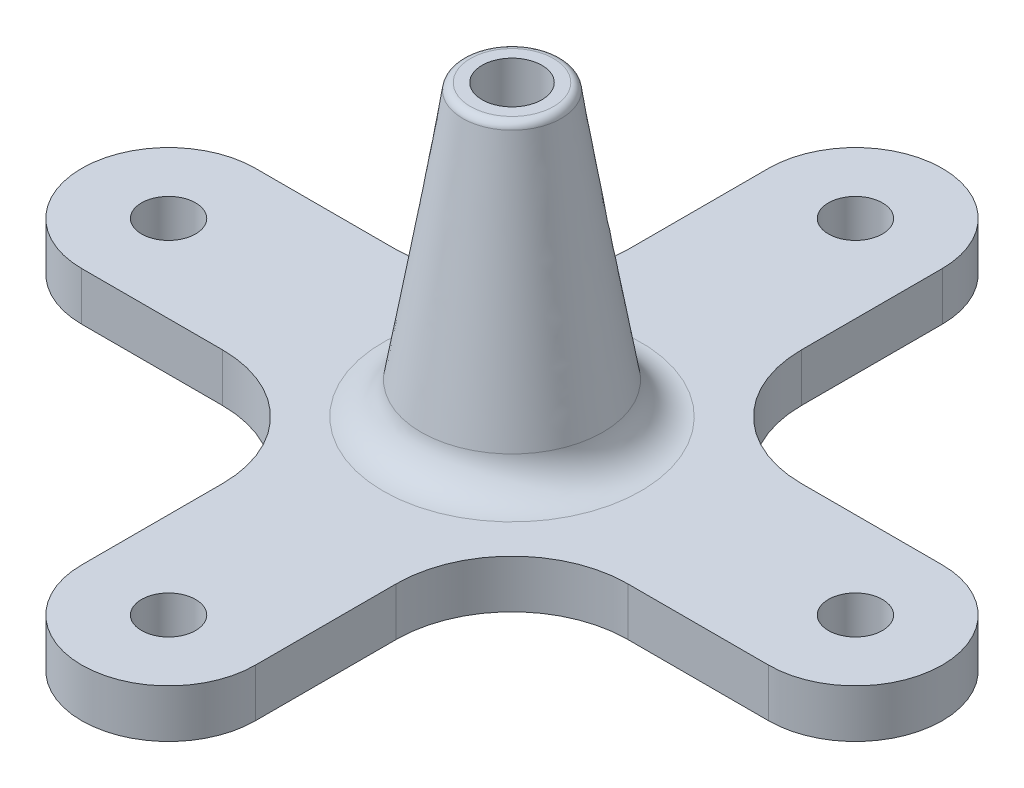
ISO-10303-21;
HEADER;
FILE_DESCRIPTION(('STEP AP214'),'2;1');
FILE_NAME('part.step','',(''),(''),'','','');
FILE_SCHEMA(('AUTOMOTIVE_DESIGN { 1 0 10303 214 1 1 1 1 }'));
ENDSEC;
DATA;
#1=APPLICATION_CONTEXT('core data for automotive mechanical design processes');
#2=APPLICATION_PROTOCOL_DEFINITION('international standard','automotive_design',2000,#1);
#3=PRODUCT_CONTEXT('',#1,'mechanical');
#4=PRODUCT('Part','Part','',(#3));
#5=PRODUCT_RELATED_PRODUCT_CATEGORY('part','',(#4));
#6=PRODUCT_DEFINITION_FORMATION('','',#4);
#7=PRODUCT_DEFINITION_CONTEXT('part definition',#1,'design');
#8=PRODUCT_DEFINITION('design','',#6,#7);
#9=PRODUCT_DEFINITION_SHAPE('','',#8);
#10=(LENGTH_UNIT() NAMED_UNIT(*) SI_UNIT(.MILLI.,.METRE.));
#11=(NAMED_UNIT(*) PLANE_ANGLE_UNIT() SI_UNIT($,.RADIAN.));
#12=(NAMED_UNIT(*) SI_UNIT($,.STERADIAN.) SOLID_ANGLE_UNIT());
#13=UNCERTAINTY_MEASURE_WITH_UNIT(LENGTH_MEASURE(1.E-05),#10,'distance_accuracy_value','');
#14=(GEOMETRIC_REPRESENTATION_CONTEXT(3) GLOBAL_UNCERTAINTY_ASSIGNED_CONTEXT((#13)) GLOBAL_UNIT_ASSIGNED_CONTEXT((#10,
#11,#12)) REPRESENTATION_CONTEXT('',''));
#15=CARTESIAN_POINT('',(0.,0.,0.));
#16=DIRECTION('',(0.,0.,1.));
#17=DIRECTION('',(1.,0.,0.));
#18=AXIS2_PLACEMENT_3D('',#15,#16,#17);
#19=CARTESIAN_POINT('',(0.,3.175,22.606));
#20=DIRECTION('',(0.,1.,0.));
#21=DIRECTION('',(0.,0.,1.));
#22=AXIS2_PLACEMENT_3D('',#19,#20,#21);
#23=PLANE('',#22);
#24=CARTESIAN_POINT('',(0.,3.175,-22.606));
#25=DIRECTION('',(0.,1.,0.));
#26=DIRECTION('',(0.,0.,1.));
#27=AXIS2_PLACEMENT_3D('',#24,#25,#26);
#28=CIRCLE('',#27,1.778);
#29=CARTESIAN_POINT('',(0.,3.175,-20.828));
#30=VERTEX_POINT('',#29);
#31=EDGE_CURVE('E410',#30,#30,#28,.T.);
#32=ORIENTED_EDGE('',*,*,#31,.F.);
#33=EDGE_LOOP('',(#32));
#34=FACE_BOUND('',#33,.T.);
#35=CARTESIAN_POINT('',(22.606,3.175,0.));
#36=DIRECTION('',(0.,1.,0.));
#37=DIRECTION('',(0.,0.,1.));
#38=AXIS2_PLACEMENT_3D('',#35,#36,#37);
#39=CIRCLE('',#38,1.778);
#40=CARTESIAN_POINT('',(22.606,3.175,1.77799999999999));
#41=VERTEX_POINT('',#40);
#42=EDGE_CURVE('E414',#41,#41,#39,.T.);
#43=ORIENTED_EDGE('',*,*,#42,.F.);
#44=EDGE_LOOP('',(#43));
#45=FACE_BOUND('',#44,.T.);
#46=CARTESIAN_POINT('',(0.,3.175,22.606));
#47=DIRECTION('',(0.,1.,0.));
#48=DIRECTION('',(0.,0.,1.));
#49=AXIS2_PLACEMENT_3D('',#46,#47,#48);
#50=CIRCLE('',#49,1.778);
#51=CARTESIAN_POINT('',(0.,3.175,24.384));
#52=VERTEX_POINT('',#51);
#53=EDGE_CURVE('E423',#52,#52,#50,.T.);
#54=ORIENTED_EDGE('',*,*,#53,.F.);
#55=EDGE_LOOP('',(#54));
#56=FACE_BOUND('',#55,.T.);
#57=CARTESIAN_POINT('',(-22.606,3.175,0.));
#58=DIRECTION('',(0.,1.,0.));
#59=DIRECTION('',(0.,0.,1.));
#60=AXIS2_PLACEMENT_3D('',#57,#58,#59);
#61=CIRCLE('',#60,1.778);
#62=CARTESIAN_POINT('',(-22.606,3.175,1.77800000000001));
#63=VERTEX_POINT('',#62);
#64=EDGE_CURVE('E426',#63,#63,#61,.T.);
#65=ORIENTED_EDGE('',*,*,#64,.F.);
#66=EDGE_LOOP('',(#65));
#67=FACE_BOUND('',#66,.T.);
#68=CARTESIAN_POINT('',(0.,3.175,0.));
#69=DIRECTION('',(0.,1.,0.));
#70=DIRECTION('',(0.,0.,1.));
#71=AXIS2_PLACEMENT_3D('',#68,#69,#70);
#72=CIRCLE('',#71,8.48394025025179);
#73=CARTESIAN_POINT('',(0.,3.175,8.48394025025179));
#74=VERTEX_POINT('',#73);
#75=EDGE_CURVE('E282',#74,#74,#72,.F.);
#76=ORIENTED_EDGE('',*,*,#75,.T.);
#77=EDGE_LOOP('',(#76));
#78=FACE_BOUND('',#77,.T.);
#79=DIRECTION('',(0.,0.,-1.));
#80=VECTOR('',#79,1.);
#81=CARTESIAN_POINT('',(-5.715,3.175,22.606));
#82=LINE('',#81,#80);
#83=CARTESIAN_POINT('',(-5.715,3.175,-13.335));
#84=VERTEX_POINT('',#83);
#85=CARTESIAN_POINT('',(-5.715,3.175,-22.606));
#86=VERTEX_POINT('',#85);
#87=EDGE_CURVE('E439',#84,#86,#82,.T.);
#88=ORIENTED_EDGE('',*,*,#87,.F.);
#89=CARTESIAN_POINT('',(-13.335,3.175,-13.335));
#90=DIRECTION('',(0.,1.,0.));
#91=DIRECTION('',(0.,0.,1.));
#92=AXIS2_PLACEMENT_3D('',#89,#90,#91);
#93=CIRCLE('',#92,7.62);
#94=CARTESIAN_POINT('',(-13.335,3.175,-5.715));
#95=VERTEX_POINT('',#94);
#96=EDGE_CURVE('E274',#84,#95,#93,.F.);
#97=ORIENTED_EDGE('',*,*,#96,.T.);
#98=DIRECTION('',(1.,0.,0.));
#99=VECTOR('',#98,1.);
#100=CARTESIAN_POINT('',(-22.606,3.175,-5.715));
#101=LINE('',#100,#99);
#102=CARTESIAN_POINT('',(-22.606,3.175,-5.715));
#103=VERTEX_POINT('',#102);
#104=EDGE_CURVE('E222',#103,#95,#101,.T.);
#105=ORIENTED_EDGE('',*,*,#104,.F.);
#106=CARTESIAN_POINT('',(-22.606,3.175,0.));
#107=DIRECTION('',(0.,1.,0.));
#108=DIRECTION('',(0.,0.,1.));
#109=AXIS2_PLACEMENT_3D('',#106,#107,#108);
#110=CIRCLE('',#109,5.715);
#111=CARTESIAN_POINT('',(-22.606,3.175,5.715));
#112=VERTEX_POINT('',#111);
#113=EDGE_CURVE('E211',#103,#112,#110,.T.);
#114=ORIENTED_EDGE('',*,*,#113,.T.);
#115=DIRECTION('',(1.,0.,0.));
#116=VECTOR('',#115,1.);
#117=CARTESIAN_POINT('',(-22.606,3.175,5.715));
#118=LINE('',#117,#116);
#119=CARTESIAN_POINT('',(-13.335,3.175,5.715));
#120=VERTEX_POINT('',#119);
#121=EDGE_CURVE('E216',#112,#120,#118,.T.);
#122=ORIENTED_EDGE('',*,*,#121,.T.);
#123=CARTESIAN_POINT('',(-13.335,3.175,13.335));
#124=DIRECTION('',(0.,1.,0.));
#125=DIRECTION('',(0.,0.,1.));
#126=AXIS2_PLACEMENT_3D('',#123,#124,#125);
#127=CIRCLE('',#126,7.62);
#128=CARTESIAN_POINT('',(-5.715,3.175,13.335));
#129=VERTEX_POINT('',#128);
#130=EDGE_CURVE('E277',#120,#129,#127,.F.);
#131=ORIENTED_EDGE('',*,*,#130,.T.);
#132=CARTESIAN_POINT('',(-5.715,3.175,22.606));
#133=VERTEX_POINT('',#132);
#134=EDGE_CURVE('E194',#133,#129,#82,.T.);
#135=ORIENTED_EDGE('',*,*,#134,.F.);
#136=CARTESIAN_POINT('',(0.,3.175,22.606));
#137=DIRECTION('',(0.,1.,0.));
#138=DIRECTION('',(0.,0.,1.));
#139=AXIS2_PLACEMENT_3D('',#136,#137,#138);
#140=CIRCLE('',#139,5.715);
#141=CARTESIAN_POINT('',(5.715,3.175,22.606));
#142=VERTEX_POINT('',#141);
#143=EDGE_CURVE('E191',#133,#142,#140,.T.);
#144=ORIENTED_EDGE('',*,*,#143,.T.);
#145=DIRECTION('',(0.,0.,-1.));
#146=VECTOR('',#145,1.);
#147=CARTESIAN_POINT('',(5.715,3.175,22.606));
#148=LINE('',#147,#146);
#149=CARTESIAN_POINT('',(5.715,3.175,13.335));
#150=VERTEX_POINT('',#149);
#151=EDGE_CURVE('E175',#142,#150,#148,.T.);
#152=ORIENTED_EDGE('',*,*,#151,.T.);
#153=CARTESIAN_POINT('',(13.335,3.175,13.335));
#154=DIRECTION('',(0.,1.,0.));
#155=DIRECTION('',(0.,0.,1.));
#156=AXIS2_PLACEMENT_3D('',#153,#154,#155);
#157=CIRCLE('',#156,7.62);
#158=CARTESIAN_POINT('',(13.335,3.175,5.715));
#159=VERTEX_POINT('',#158);
#160=EDGE_CURVE('E266',#150,#159,#157,.F.);
#161=ORIENTED_EDGE('',*,*,#160,.T.);
#162=CARTESIAN_POINT('',(22.606,3.175,5.715));
#163=VERTEX_POINT('',#162);
#164=EDGE_CURVE('E214',#159,#163,#118,.T.);
#165=ORIENTED_EDGE('',*,*,#164,.T.);
#166=CARTESIAN_POINT('',(22.606,3.175,0.));
#167=DIRECTION('',(0.,1.,0.));
#168=DIRECTION('',(0.,0.,1.));
#169=AXIS2_PLACEMENT_3D('',#166,#167,#168);
#170=CIRCLE('',#169,5.715);
#171=CARTESIAN_POINT('',(22.606,3.175,-5.715));
#172=VERTEX_POINT('',#171);
#173=EDGE_CURVE('E218',#163,#172,#170,.T.);
#174=ORIENTED_EDGE('',*,*,#173,.T.);
#175=CARTESIAN_POINT('',(13.335,3.175,-5.715));
#176=VERTEX_POINT('',#175);
#177=EDGE_CURVE('E221',#176,#172,#101,.T.);
#178=ORIENTED_EDGE('',*,*,#177,.F.);
#179=CARTESIAN_POINT('',(13.335,3.175,-13.335));
#180=DIRECTION('',(0.,1.,0.));
#181=DIRECTION('',(0.,0.,1.));
#182=AXIS2_PLACEMENT_3D('',#179,#180,#181);
#183=CIRCLE('',#182,7.62);
#184=CARTESIAN_POINT('',(5.715,3.175,-13.335));
#185=VERTEX_POINT('',#184);
#186=EDGE_CURVE('E270',#176,#185,#183,.F.);
#187=ORIENTED_EDGE('',*,*,#186,.T.);
#188=CARTESIAN_POINT('',(5.715,3.175,-22.606));
#189=VERTEX_POINT('',#188);
#190=EDGE_CURVE('E187',#185,#189,#148,.T.);
#191=ORIENTED_EDGE('',*,*,#190,.T.);
#192=CARTESIAN_POINT('',(0.,3.175,-22.606));
#193=DIRECTION('',(0.,1.,0.));
#194=DIRECTION('',(0.,0.,1.));
#195=AXIS2_PLACEMENT_3D('',#192,#193,#194);
#196=CIRCLE('',#195,5.715);
#197=EDGE_CURVE('E186',#189,#86,#196,.T.);
#198=ORIENTED_EDGE('',*,*,#197,.T.);
#199=EDGE_LOOP('',(#88,#97,#105,#114,#122,#131,#135,#144,#152,#161,#165,#174,#178,#187,#191,#198));
#200=FACE_BOUND('',#199,.T.);
#201=ADVANCED_FACE('F62',(#34,#45,#56,#67,#78,#200),#23,.T.);
#202=CARTESIAN_POINT('',(0.,3.175,-22.606));
#203=DIRECTION('',(0.,-1.,0.));
#204=DIRECTION('',(0.,0.,-1.));
#205=AXIS2_PLACEMENT_3D('',#202,#203,#204);
#206=CYLINDRICAL_SURFACE('',#205,5.715);
#207=CARTESIAN_POINT('',(0.,0.,-22.606));
#208=DIRECTION('',(0.,1.,0.));
#209=DIRECTION('',(0.,0.,1.));
#210=AXIS2_PLACEMENT_3D('',#207,#208,#209);
#211=CIRCLE('',#210,5.715);
#212=CARTESIAN_POINT('',(5.715,0.,-22.606));
#213=VERTEX_POINT('',#212);
#214=CARTESIAN_POINT('',(-5.715,0.,-22.606));
#215=VERTEX_POINT('',#214);
#216=EDGE_CURVE('E446',#213,#215,#211,.T.);
#217=ORIENTED_EDGE('',*,*,#216,.T.);
#218=DIRECTION('',(0.,-1.,0.));
#219=VECTOR('',#218,1.);
#220=CARTESIAN_POINT('',(-5.715,3.175,-22.606));
#221=LINE('',#220,#219);
#222=EDGE_CURVE('E207',#86,#215,#221,.T.);
#223=ORIENTED_EDGE('',*,*,#222,.F.);
#224=ORIENTED_EDGE('',*,*,#197,.F.);
#225=DIRECTION('',(0.,-1.,0.));
#226=VECTOR('',#225,1.);
#227=CARTESIAN_POINT('',(5.715,3.175,-22.606));
#228=LINE('',#227,#226);
#229=EDGE_CURVE('E202',#189,#213,#228,.T.);
#230=ORIENTED_EDGE('',*,*,#229,.T.);
#231=EDGE_LOOP('',(#217,#223,#224,#230));
#232=FACE_BOUND('',#231,.T.);
#233=ADVANCED_FACE('F306',(#232),#206,.T.);
#234=CARTESIAN_POINT('',(-5.715,3.175,22.606));
#235=DIRECTION('',(-1.,0.,0.));
#236=DIRECTION('',(0.,0.,1.));
#237=AXIS2_PLACEMENT_3D('',#234,#235,#236);
#238=PLANE('',#237);
#239=DIRECTION('',(0.,0.,-1.));
#240=VECTOR('',#239,1.);
#241=CARTESIAN_POINT('',(-5.715,0.,22.606));
#242=LINE('',#241,#240);
#243=CARTESIAN_POINT('',(-5.715,0.,-13.335));
#244=VERTEX_POINT('',#243);
#245=EDGE_CURVE('E449',#244,#215,#242,.T.);
#246=ORIENTED_EDGE('',*,*,#245,.F.);
#247=DIRECTION('',(0.,-1.,0.));
#248=VECTOR('',#247,1.);
#249=CARTESIAN_POINT('',(-5.715,3.175,-13.335));
#250=LINE('',#249,#248);
#251=EDGE_CURVE('E258',#244,#84,#250,.F.);
#252=ORIENTED_EDGE('',*,*,#251,.T.);
#253=ORIENTED_EDGE('',*,*,#87,.T.);
#254=ORIENTED_EDGE('',*,*,#222,.T.);
#255=EDGE_LOOP('',(#246,#252,#253,#254));
#256=FACE_BOUND('',#255,.T.);
#257=ADVANCED_FACE('F312',(#256),#238,.T.);
#258=CARTESIAN_POINT('',(5.715,3.175,22.606));
#259=DIRECTION('',(-1.,0.,0.));
#260=DIRECTION('',(0.,0.,1.));
#261=AXIS2_PLACEMENT_3D('',#258,#259,#260);
#262=PLANE('',#261);
#263=ORIENTED_EDGE('',*,*,#190,.F.);
#264=DIRECTION('',(0.,-1.,0.));
#265=VECTOR('',#264,1.);
#266=CARTESIAN_POINT('',(5.715,3.175,-13.335));
#267=LINE('',#266,#265);
#268=CARTESIAN_POINT('',(5.715,0.,-13.335));
#269=VERTEX_POINT('',#268);
#270=EDGE_CURVE('E250',#185,#269,#267,.T.);
#271=ORIENTED_EDGE('',*,*,#270,.T.);
#272=DIRECTION('',(0.,0.,-1.));
#273=VECTOR('',#272,1.);
#274=CARTESIAN_POINT('',(5.715,0.,22.606));
#275=LINE('',#274,#273);
#276=EDGE_CURVE('E443',#269,#213,#275,.T.);
#277=ORIENTED_EDGE('',*,*,#276,.T.);
#278=ORIENTED_EDGE('',*,*,#229,.F.);
#279=EDGE_LOOP('',(#263,#271,#277,#278));
#280=FACE_BOUND('',#279,.T.);
#281=ADVANCED_FACE('F324',(#280),#262,.F.);
#282=CARTESIAN_POINT('',(0.,0.,22.606));
#283=DIRECTION('',(0.,1.,0.));
#284=DIRECTION('',(0.,0.,1.));
#285=AXIS2_PLACEMENT_3D('',#282,#283,#284);
#286=PLANE('',#285);
#287=CARTESIAN_POINT('',(0.,0.,-22.606));
#288=DIRECTION('',(0.,1.,0.));
#289=DIRECTION('',(0.,0.,1.));
#290=AXIS2_PLACEMENT_3D('',#287,#288,#289);
#291=CIRCLE('',#290,1.778);
#292=CARTESIAN_POINT('',(0.,0.,-20.828));
#293=VERTEX_POINT('',#292);
#294=EDGE_CURVE('E408',#293,#293,#291,.F.);
#295=ORIENTED_EDGE('',*,*,#294,.F.);
#296=EDGE_LOOP('',(#295));
#297=FACE_BOUND('',#296,.T.);
#298=CARTESIAN_POINT('',(22.606,0.,0.));
#299=DIRECTION('',(0.,1.,0.));
#300=DIRECTION('',(0.,0.,1.));
#301=AXIS2_PLACEMENT_3D('',#298,#299,#300);
#302=CIRCLE('',#301,1.778);
#303=CARTESIAN_POINT('',(22.606,0.,1.77799999999999));
#304=VERTEX_POINT('',#303);
#305=EDGE_CURVE('E411',#304,#304,#302,.F.);
#306=ORIENTED_EDGE('',*,*,#305,.F.);
#307=EDGE_LOOP('',(#306));
#308=FACE_BOUND('',#307,.T.);
#309=CARTESIAN_POINT('',(0.,0.,22.606));
#310=DIRECTION('',(0.,1.,0.));
#311=DIRECTION('',(0.,0.,1.));
#312=AXIS2_PLACEMENT_3D('',#309,#310,#311);
#313=CIRCLE('',#312,1.778);
#314=CARTESIAN_POINT('',(0.,0.,24.384));
#315=VERTEX_POINT('',#314);
#316=EDGE_CURVE('E420',#315,#315,#313,.F.);
#317=ORIENTED_EDGE('',*,*,#316,.F.);
#318=EDGE_LOOP('',(#317));
#319=FACE_BOUND('',#318,.T.);
#320=CARTESIAN_POINT('',(-22.606,0.,0.));
#321=DIRECTION('',(0.,1.,0.));
#322=DIRECTION('',(0.,0.,1.));
#323=AXIS2_PLACEMENT_3D('',#320,#321,#322);
#324=CIRCLE('',#323,1.778);
#325=CARTESIAN_POINT('',(-22.606,0.,1.77800000000001));
#326=VERTEX_POINT('',#325);
#327=EDGE_CURVE('E429',#326,#326,#324,.F.);
#328=ORIENTED_EDGE('',*,*,#327,.F.);
#329=EDGE_LOOP('',(#328));
#330=FACE_BOUND('',#329,.T.);
#331=ORIENTED_EDGE('',*,*,#276,.F.);
#332=CARTESIAN_POINT('',(13.335,0.,-13.335));
#333=DIRECTION('',(0.,1.,0.));
#334=DIRECTION('',(0.,0.,1.));
#335=AXIS2_PLACEMENT_3D('',#332,#333,#334);
#336=CIRCLE('',#335,7.62);
#337=CARTESIAN_POINT('',(13.335,0.,-5.715));
#338=VERTEX_POINT('',#337);
#339=EDGE_CURVE('E268',#269,#338,#336,.T.);
#340=ORIENTED_EDGE('',*,*,#339,.T.);
#341=DIRECTION('',(1.,0.,0.));
#342=VECTOR('',#341,1.);
#343=CARTESIAN_POINT('',(-22.606,0.,-5.715));
#344=LINE('',#343,#342);
#345=CARTESIAN_POINT('',(22.606,0.,-5.715));
#346=VERTEX_POINT('',#345);
#347=EDGE_CURVE('E236',#338,#346,#344,.T.);
#348=ORIENTED_EDGE('',*,*,#347,.T.);
#349=CARTESIAN_POINT('',(22.606,0.,0.));
#350=DIRECTION('',(0.,1.,0.));
#351=DIRECTION('',(0.,0.,1.));
#352=AXIS2_PLACEMENT_3D('',#349,#350,#351);
#353=CIRCLE('',#352,5.715);
#354=CARTESIAN_POINT('',(22.606,0.,5.715));
#355=VERTEX_POINT('',#354);
#356=EDGE_CURVE('E233',#355,#346,#353,.T.);
#357=ORIENTED_EDGE('',*,*,#356,.F.);
#358=DIRECTION('',(1.,0.,0.));
#359=VECTOR('',#358,1.);
#360=CARTESIAN_POINT('',(-22.606,0.,5.715));
#361=LINE('',#360,#359);
#362=CARTESIAN_POINT('',(13.335,0.,5.715));
#363=VERTEX_POINT('',#362);
#364=EDGE_CURVE('E229',#363,#355,#361,.T.);
#365=ORIENTED_EDGE('',*,*,#364,.F.);
#366=CARTESIAN_POINT('',(13.335,0.,13.335));
#367=DIRECTION('',(0.,1.,0.));
#368=DIRECTION('',(0.,0.,1.));
#369=AXIS2_PLACEMENT_3D('',#366,#367,#368);
#370=CIRCLE('',#369,7.62);
#371=CARTESIAN_POINT('',(5.715,0.,13.335));
#372=VERTEX_POINT('',#371);
#373=EDGE_CURVE('E264',#363,#372,#370,.T.);
#374=ORIENTED_EDGE('',*,*,#373,.T.);
#375=CARTESIAN_POINT('',(5.715,0.,22.606));
#376=VERTEX_POINT('',#375);
#377=EDGE_CURVE('E444',#376,#372,#275,.T.);
#378=ORIENTED_EDGE('',*,*,#377,.F.);
#379=CARTESIAN_POINT('',(0.,0.,22.606));
#380=DIRECTION('',(0.,1.,0.));
#381=DIRECTION('',(0.,0.,1.));
#382=AXIS2_PLACEMENT_3D('',#379,#380,#381);
#383=CIRCLE('',#382,5.715);
#384=CARTESIAN_POINT('',(-5.715,0.,22.606));
#385=VERTEX_POINT('',#384);
#386=EDGE_CURVE('E200',#385,#376,#383,.T.);
#387=ORIENTED_EDGE('',*,*,#386,.F.);
#388=CARTESIAN_POINT('',(-5.715,0.,13.335));
#389=VERTEX_POINT('',#388);
#390=EDGE_CURVE('E196',#385,#389,#242,.T.);
#391=ORIENTED_EDGE('',*,*,#390,.T.);
#392=CARTESIAN_POINT('',(-13.335,0.,13.335));
#393=DIRECTION('',(0.,1.,0.));
#394=DIRECTION('',(0.,0.,1.));
#395=AXIS2_PLACEMENT_3D('',#392,#393,#394);
#396=CIRCLE('',#395,7.62);
#397=CARTESIAN_POINT('',(-13.335,0.,5.715));
#398=VERTEX_POINT('',#397);
#399=EDGE_CURVE('E77',#389,#398,#396,.T.);
#400=ORIENTED_EDGE('',*,*,#399,.T.);
#401=CARTESIAN_POINT('',(-22.606,0.,5.715));
#402=VERTEX_POINT('',#401);
#403=EDGE_CURVE('E231',#402,#398,#361,.T.);
#404=ORIENTED_EDGE('',*,*,#403,.F.);
#405=CARTESIAN_POINT('',(-22.606,0.,0.));
#406=DIRECTION('',(0.,1.,0.));
#407=DIRECTION('',(0.,0.,1.));
#408=AXIS2_PLACEMENT_3D('',#405,#406,#407);
#409=CIRCLE('',#408,5.715);
#410=CARTESIAN_POINT('',(-22.606,0.,-5.715));
#411=VERTEX_POINT('',#410);
#412=EDGE_CURVE('E226',#411,#402,#409,.T.);
#413=ORIENTED_EDGE('',*,*,#412,.F.);
#414=CARTESIAN_POINT('',(-13.335,0.,-5.715));
#415=VERTEX_POINT('',#414);
#416=EDGE_CURVE('E215',#411,#415,#344,.T.);
#417=ORIENTED_EDGE('',*,*,#416,.T.);
#418=CARTESIAN_POINT('',(-13.335,0.,-13.335));
#419=DIRECTION('',(0.,1.,0.));
#420=DIRECTION('',(0.,0.,1.));
#421=AXIS2_PLACEMENT_3D('',#418,#419,#420);
#422=CIRCLE('',#421,7.62);
#423=EDGE_CURVE('E272',#415,#244,#422,.T.);
#424=ORIENTED_EDGE('',*,*,#423,.T.);
#425=ORIENTED_EDGE('',*,*,#245,.T.);
#426=ORIENTED_EDGE('',*,*,#216,.F.);
#427=EDGE_LOOP('',(#331,#340,#348,#357,#365,#374,#378,#387,#391,#400,#404,#413,#417,#424,#425,#426));
#428=FACE_BOUND('',#427,.T.);
#429=ADVANCED_FACE('F320',(#297,#308,#319,#330,#428),#286,.F.);
#430=ORIENTED_EDGE('',*,*,#134,.T.);
#431=DIRECTION('',(0.,-1.,0.));
#432=VECTOR('',#431,1.);
#433=CARTESIAN_POINT('',(-5.715,3.175,13.335));
#434=LINE('',#433,#432);
#435=EDGE_CURVE('E260',#129,#389,#434,.T.);
#436=ORIENTED_EDGE('',*,*,#435,.T.);
#437=ORIENTED_EDGE('',*,*,#390,.F.);
#438=DIRECTION('',(0.,-1.,0.));
#439=VECTOR('',#438,1.);
#440=CARTESIAN_POINT('',(-5.715,3.175,22.606));
#441=LINE('',#440,#439);
#442=EDGE_CURVE('E441',#133,#385,#441,.T.);
#443=ORIENTED_EDGE('',*,*,#442,.F.);
#444=EDGE_LOOP('',(#430,#436,#437,#443));
#445=FACE_BOUND('',#444,.T.);
#446=ADVANCED_FACE('F323',(#445),#238,.T.);
#447=CARTESIAN_POINT('',(0.,3.175,22.606));
#448=DIRECTION('',(0.,-1.,0.));
#449=DIRECTION('',(0.,0.,-1.));
#450=AXIS2_PLACEMENT_3D('',#447,#448,#449);
#451=CYLINDRICAL_SURFACE('',#450,5.715);
#452=ORIENTED_EDGE('',*,*,#386,.T.);
#453=DIRECTION('',(0.,-1.,0.));
#454=VECTOR('',#453,1.);
#455=CARTESIAN_POINT('',(5.715,3.175,22.606));
#456=LINE('',#455,#454);
#457=EDGE_CURVE('E180',#142,#376,#456,.T.);
#458=ORIENTED_EDGE('',*,*,#457,.F.);
#459=ORIENTED_EDGE('',*,*,#143,.F.);
#460=ORIENTED_EDGE('',*,*,#442,.T.);
#461=EDGE_LOOP('',(#452,#458,#459,#460));
#462=FACE_BOUND('',#461,.T.);
#463=ADVANCED_FACE('F198',(#462),#451,.T.);
#464=ORIENTED_EDGE('',*,*,#377,.T.);
#465=DIRECTION('',(0.,-1.,0.));
#466=VECTOR('',#465,1.);
#467=CARTESIAN_POINT('',(5.715,3.175,13.335));
#468=LINE('',#467,#466);
#469=EDGE_CURVE('E183',#372,#150,#468,.F.);
#470=ORIENTED_EDGE('',*,*,#469,.T.);
#471=ORIENTED_EDGE('',*,*,#151,.F.);
#472=ORIENTED_EDGE('',*,*,#457,.T.);
#473=EDGE_LOOP('',(#464,#470,#471,#472));
#474=FACE_BOUND('',#473,.T.);
#475=ADVANCED_FACE('F178',(#474),#262,.F.);
#476=CARTESIAN_POINT('',(-22.606,3.175,-5.715));
#477=DIRECTION('',(0.,0.,-1.));
#478=DIRECTION('',(-1.,0.,0.));
#479=AXIS2_PLACEMENT_3D('',#476,#477,#478);
#480=PLANE('',#479);
#481=ORIENTED_EDGE('',*,*,#104,.T.);
#482=DIRECTION('',(0.,-1.,0.));
#483=VECTOR('',#482,1.);
#484=CARTESIAN_POINT('',(-13.335,0.,-5.715));
#485=LINE('',#484,#483);
#486=EDGE_CURVE('E255',#95,#415,#485,.T.);
#487=ORIENTED_EDGE('',*,*,#486,.T.);
#488=ORIENTED_EDGE('',*,*,#416,.F.);
#489=DIRECTION('',(0.,-1.,0.));
#490=VECTOR('',#489,1.);
#491=CARTESIAN_POINT('',(-22.606,3.175,-5.715));
#492=LINE('',#491,#490);
#493=EDGE_CURVE('E225',#103,#411,#492,.T.);
#494=ORIENTED_EDGE('',*,*,#493,.F.);
#495=EDGE_LOOP('',(#481,#487,#488,#494));
#496=FACE_BOUND('',#495,.T.);
#497=ADVANCED_FACE('F334',(#496),#480,.T.);
#498=CARTESIAN_POINT('',(-22.606,3.175,0.));
#499=DIRECTION('',(0.,-1.,0.));
#500=DIRECTION('',(0.,0.,-1.));
#501=AXIS2_PLACEMENT_3D('',#498,#499,#500);
#502=CYLINDRICAL_SURFACE('',#501,5.715);
#503=ORIENTED_EDGE('',*,*,#412,.T.);
#504=DIRECTION('',(0.,-1.,0.));
#505=VECTOR('',#504,1.);
#506=CARTESIAN_POINT('',(-22.606,3.175,5.715));
#507=LINE('',#506,#505);
#508=EDGE_CURVE('E246',#112,#402,#507,.T.);
#509=ORIENTED_EDGE('',*,*,#508,.F.);
#510=ORIENTED_EDGE('',*,*,#113,.F.);
#511=ORIENTED_EDGE('',*,*,#493,.T.);
#512=EDGE_LOOP('',(#503,#509,#510,#511));
#513=FACE_BOUND('',#512,.T.);
#514=ADVANCED_FACE('F337',(#513),#502,.T.);
#515=CARTESIAN_POINT('',(-22.606,3.175,5.715));
#516=DIRECTION('',(0.,0.,-1.));
#517=DIRECTION('',(-1.,0.,0.));
#518=AXIS2_PLACEMENT_3D('',#515,#516,#517);
#519=PLANE('',#518);
#520=ORIENTED_EDGE('',*,*,#403,.T.);
#521=DIRECTION('',(0.,-1.,0.));
#522=VECTOR('',#521,1.);
#523=CARTESIAN_POINT('',(-13.335,3.175,5.715));
#524=LINE('',#523,#522);
#525=EDGE_CURVE('E84',#398,#120,#524,.F.);
#526=ORIENTED_EDGE('',*,*,#525,.T.);
#527=ORIENTED_EDGE('',*,*,#121,.F.);
#528=ORIENTED_EDGE('',*,*,#508,.T.);
#529=EDGE_LOOP('',(#520,#526,#527,#528));
#530=FACE_BOUND('',#529,.T.);
#531=ADVANCED_FACE('F343',(#530),#519,.F.);
#532=CARTESIAN_POINT('',(22.606,3.175,0.));
#533=DIRECTION('',(0.,-1.,0.));
#534=DIRECTION('',(0.,0.,-1.));
#535=AXIS2_PLACEMENT_3D('',#532,#533,#534);
#536=CYLINDRICAL_SURFACE('',#535,5.715);
#537=ORIENTED_EDGE('',*,*,#356,.T.);
#538=DIRECTION('',(0.,-1.,0.));
#539=VECTOR('',#538,1.);
#540=CARTESIAN_POINT('',(22.606,3.175,-5.715));
#541=LINE('',#540,#539);
#542=EDGE_CURVE('E240',#172,#346,#541,.T.);
#543=ORIENTED_EDGE('',*,*,#542,.F.);
#544=ORIENTED_EDGE('',*,*,#173,.F.);
#545=DIRECTION('',(0.,-1.,0.));
#546=VECTOR('',#545,1.);
#547=CARTESIAN_POINT('',(22.606,3.175,5.715));
#548=LINE('',#547,#546);
#549=EDGE_CURVE('E243',#163,#355,#548,.T.);
#550=ORIENTED_EDGE('',*,*,#549,.T.);
#551=EDGE_LOOP('',(#537,#543,#544,#550));
#552=FACE_BOUND('',#551,.T.);
#553=ADVANCED_FACE('F340',(#552),#536,.T.);
#554=ORIENTED_EDGE('',*,*,#347,.F.);
#555=DIRECTION('',(0.,-1.,0.));
#556=VECTOR('',#555,1.);
#557=CARTESIAN_POINT('',(13.335,3.175,-5.715));
#558=LINE('',#557,#556);
#559=EDGE_CURVE('E253',#338,#176,#558,.F.);
#560=ORIENTED_EDGE('',*,*,#559,.T.);
#561=ORIENTED_EDGE('',*,*,#177,.T.);
#562=ORIENTED_EDGE('',*,*,#542,.T.);
#563=EDGE_LOOP('',(#554,#560,#561,#562));
#564=FACE_BOUND('',#563,.T.);
#565=ADVANCED_FACE('F339',(#564),#480,.T.);
#566=ORIENTED_EDGE('',*,*,#164,.F.);
#567=DIRECTION('',(0.,-1.,0.));
#568=VECTOR('',#567,1.);
#569=CARTESIAN_POINT('',(13.335,0.,5.715));
#570=LINE('',#569,#568);
#571=EDGE_CURVE('E201',#159,#363,#570,.T.);
#572=ORIENTED_EDGE('',*,*,#571,.T.);
#573=ORIENTED_EDGE('',*,*,#364,.T.);
#574=ORIENTED_EDGE('',*,*,#549,.F.);
#575=EDGE_LOOP('',(#566,#572,#573,#574));
#576=FACE_BOUND('',#575,.T.);
#577=ADVANCED_FACE('F348',(#576),#519,.F.);
#578=CARTESIAN_POINT('',(13.335,3.175,13.335));
#579=DIRECTION('',(0.,1.,0.));
#580=DIRECTION('',(0.,0.,1.));
#581=AXIS2_PLACEMENT_3D('',#578,#579,#580);
#582=CYLINDRICAL_SURFACE('',#581,7.62);
#583=ORIENTED_EDGE('',*,*,#160,.F.);
#584=ORIENTED_EDGE('',*,*,#469,.F.);
#585=ORIENTED_EDGE('',*,*,#373,.F.);
#586=ORIENTED_EDGE('',*,*,#571,.F.);
#587=EDGE_LOOP('',(#583,#584,#585,#586));
#588=FACE_BOUND('',#587,.T.);
#589=ADVANCED_FACE('F345',(#588),#582,.F.);
#590=CARTESIAN_POINT('',(13.335,3.175,-13.335));
#591=DIRECTION('',(0.,-1.,0.));
#592=DIRECTION('',(0.,0.,-1.));
#593=AXIS2_PLACEMENT_3D('',#590,#591,#592);
#594=CYLINDRICAL_SURFACE('',#593,7.62);
#595=ORIENTED_EDGE('',*,*,#186,.F.);
#596=ORIENTED_EDGE('',*,*,#559,.F.);
#597=ORIENTED_EDGE('',*,*,#339,.F.);
#598=ORIENTED_EDGE('',*,*,#270,.F.);
#599=EDGE_LOOP('',(#595,#596,#597,#598));
#600=FACE_BOUND('',#599,.T.);
#601=ADVANCED_FACE('F354',(#600),#594,.F.);
#602=CARTESIAN_POINT('',(-13.335,3.175,-13.335));
#603=DIRECTION('',(0.,1.,0.));
#604=DIRECTION('',(0.,0.,1.));
#605=AXIS2_PLACEMENT_3D('',#602,#603,#604);
#606=CYLINDRICAL_SURFACE('',#605,7.62);
#607=ORIENTED_EDGE('',*,*,#96,.F.);
#608=ORIENTED_EDGE('',*,*,#251,.F.);
#609=ORIENTED_EDGE('',*,*,#423,.F.);
#610=ORIENTED_EDGE('',*,*,#486,.F.);
#611=EDGE_LOOP('',(#607,#608,#609,#610));
#612=FACE_BOUND('',#611,.T.);
#613=ADVANCED_FACE('F358',(#612),#606,.F.);
#614=CARTESIAN_POINT('',(-13.335,3.175,13.335));
#615=DIRECTION('',(0.,-1.,0.));
#616=DIRECTION('',(0.,0.,-1.));
#617=AXIS2_PLACEMENT_3D('',#614,#615,#616);
#618=CYLINDRICAL_SURFACE('',#617,7.62);
#619=ORIENTED_EDGE('',*,*,#130,.F.);
#620=ORIENTED_EDGE('',*,*,#525,.F.);
#621=ORIENTED_EDGE('',*,*,#399,.F.);
#622=ORIENTED_EDGE('',*,*,#435,.F.);
#623=EDGE_LOOP('',(#619,#620,#621,#622));
#624=FACE_BOUND('',#623,.T.);
#625=ADVANCED_FACE('F362',(#624),#618,.F.);
#626=CARTESIAN_POINT('',(0.,22.225,0.));
#627=DIRECTION('',(0.,1.,0.));
#628=DIRECTION('',(0.,0.,1.));
#629=AXIS2_PLACEMENT_3D('',#626,#627,#628);
#630=PLANE('',#629);
#631=CARTESIAN_POINT('',(0.,22.225,0.));
#632=DIRECTION('',(0.,1.,0.));
#633=DIRECTION('',(0.,0.,1.));
#634=AXIS2_PLACEMENT_3D('',#631,#632,#633);
#635=CIRCLE('',#634,2.73734513507231);
#636=CARTESIAN_POINT('',(0.,22.225,2.73734513507231));
#637=VERTEX_POINT('',#636);
#638=EDGE_CURVE('E70',#637,#637,#635,.T.);
#639=ORIENTED_EDGE('',*,*,#638,.T.);
#640=EDGE_LOOP('',(#639));
#641=FACE_BOUND('',#640,.T.);
#642=CARTESIAN_POINT('',(0.,22.225,0.));
#643=DIRECTION('',(0.,1.,0.));
#644=DIRECTION('',(0.,0.,1.));
#645=AXIS2_PLACEMENT_3D('',#642,#643,#644);
#646=CIRCLE('',#645,1.9685);
#647=CARTESIAN_POINT('',(0.,22.225,1.9685));
#648=VERTEX_POINT('',#647);
#649=EDGE_CURVE('E432',#648,#648,#646,.T.);
#650=ORIENTED_EDGE('',*,*,#649,.F.);
#651=EDGE_LOOP('',(#650));
#652=FACE_BOUND('',#651,.T.);
#653=ADVANCED_FACE('F287',(#641,#652),#630,.T.);
#654=CARTESIAN_POINT('',(-2.86505068620571,3.175,-5.66692020108561));
#655=CARTESIAN_POINT('',(-2.27031098334502,22.225,-2.21952991394641));
#656=CARTESIAN_POINT('',(-14.1988910883769,3.175,0.0631811713258145));
#657=CARTESIAN_POINT('',(-6.70937081123784,22.225,2.32109205274363));
#658=CARTESIAN_POINT('',(-8.4687897159655,3.175,11.397021573497));
#659=CARTESIAN_POINT('',(-2.1687488445478,22.225,6.76015188063645));
#660=CARTESIAN_POINT('',(2.86505068620571,3.175,5.66692020108561));
#661=CARTESIAN_POINT('',(2.27031098334502,22.225,2.21952991394641));
#662=CARTESIAN_POINT('',(14.1988910883769,3.175,-0.0631811713258127));
#663=CARTESIAN_POINT('',(6.70937081123784,22.225,-2.32109205274363));
#664=CARTESIAN_POINT('',(8.46878971596551,3.175,-11.397021573497));
#665=CARTESIAN_POINT('',(2.1687488445478,22.225,-6.76015188063645));
#666=CARTESIAN_POINT('',(-2.86505068620571,3.175,-5.66692020108561));
#667=CARTESIAN_POINT('',(-2.27031098334502,22.225,-2.21952991394641));
#668=(BOUNDED_SURFACE() B_SPLINE_SURFACE(3,1,((#654,#655),(#656,#657),(#658,#659),(#660,#661),
(#662,#663),(#664,#665),(#666,#667)),.UNSPECIFIED.,.T.,.F.,.F.) B_SPLINE_SURFACE_WITH_KNOTS((4,
3,4),(2,2),(0.,0.5,1.),(0.,1.),
.UNSPECIFIED.) GEOMETRIC_REPRESENTATION_ITEM() RATIONAL_B_SPLINE_SURFACE(((1.,1.),
(0.333333333333334,0.333333333333333),(0.333333333333334,0.333333333333333),(1.,1.),
(0.333333333333333,0.333333333333333),(0.333333333333333,0.333333333333333),(1.,1.))) REPRESENTATION_ITEM('') SURFACE());
#669=CARTESIAN_POINT('',(0.,21.7925338280413,0.));
#670=DIRECTION('',(0.,1.,0.));
#671=DIRECTION('',(0.,0.,1.));
#672=AXIS2_PLACEMENT_3D('',#669,#670,#671);
#673=CIRCLE('',#672,3.23969823879661);
#674=CARTESIAN_POINT('',(-2.28381254778639,21.7925338280413,-2.2977913145095));
#675=VERTEX_POINT('',#674);
#676=EDGE_CURVE('E12',#675,#675,#673,.F.);
#677=CARTESIAN_POINT('',(0.,5.27828041127409,0.));
#678=DIRECTION('',(0.,1.,0.));
#679=DIRECTION('',(0.,0.,1.));
#680=AXIS2_PLACEMENT_3D('',#677,#678,#679);
#681=CIRCLE('',#680,5.98176599556387);
#682=CARTESIAN_POINT('',(-2.79938641498084,5.27828041127409,-5.28629928449997));
#683=VERTEX_POINT('',#682);
#684=EDGE_CURVE('E279',#683,#683,#681,.T.);
#685=CARTESIAN_POINT('',(-2.28381254778639,21.7925338280413,-2.2977913145095));
#686=CARTESIAN_POINT('',(-2.289183108903,21.6205103549499,-2.32892160586357));
#687=CARTESIAN_POINT('',(-2.29455367001961,21.4484868818586,-2.36005189721763));
#688=CARTESIAN_POINT('',(-2.30529479225282,21.104439935676,-2.42231247992577));
#689=CARTESIAN_POINT('',(-2.31066535336943,20.9324164625846,-2.45344277127984));
#690=CARTESIAN_POINT('',(-2.32140647560265,20.588369516402,-2.51570335398797));
#691=CARTESIAN_POINT('',(-2.32677703671926,20.4163460433107,-2.54683364534204));
#692=CARTESIAN_POINT('',(-2.33751815895248,20.072299097128,-2.60909422805017));
#693=CARTESIAN_POINT('',(-2.34288872006909,19.9002756240367,-2.64022451940424));
#694=CARTESIAN_POINT('',(-2.3536298423023,19.556228677854,-2.70248510211238));
#695=CARTESIAN_POINT('',(-2.35900040341891,19.3842052047627,-2.73361539346644));
#696=CARTESIAN_POINT('',(-2.36974152565213,19.0401582585801,-2.79587597617458));
#697=CARTESIAN_POINT('',(-2.37511208676874,18.8681347854887,-2.82700626752864));
#698=CARTESIAN_POINT('',(-2.38585320900196,18.5240878393061,-2.88926685023678));
#699=CARTESIAN_POINT('',(-2.39122377011857,18.3520643662148,-2.92039714159085));
#700=CARTESIAN_POINT('',(-2.40196489235178,18.0080174200321,-2.98265772429898));
#701=CARTESIAN_POINT('',(-2.40733545346839,17.8359939469408,-3.01378801565305));
#702=CARTESIAN_POINT('',(-2.41807657570161,17.4919470007581,-3.07604859836118));
#703=CARTESIAN_POINT('',(-2.42344713681822,17.3199235276668,-3.10717888971525));
#704=CARTESIAN_POINT('',(-2.43418825905144,16.9758765814842,-3.16943947242339));
#705=CARTESIAN_POINT('',(-2.43955882016805,16.8038531083928,-3.20056976377745));
#706=CARTESIAN_POINT('',(-2.45029994240126,16.4598061622102,-3.26283034648559));
#707=CARTESIAN_POINT('',(-2.45567050351787,16.2877826891189,-3.29396063783966));
#708=CARTESIAN_POINT('',(-2.46641162575109,15.9437357429362,-3.35622122054779));
#709=CARTESIAN_POINT('',(-2.4717821868677,15.7717122698449,-3.38735151190186));
#710=CARTESIAN_POINT('',(-2.48252330910092,15.4276653236622,-3.44961209460999));
#711=CARTESIAN_POINT('',(-2.48789387021753,15.2556418505709,-3.48074238596406));
#712=CARTESIAN_POINT('',(-2.49863499245074,14.9115949043883,-3.5430029686722));
#713=CARTESIAN_POINT('',(-2.50400555356735,14.7395714312969,-3.57413326002626));
#714=CARTESIAN_POINT('',(-2.51474667580057,14.3955244851143,-3.6363938427344));
#715=CARTESIAN_POINT('',(-2.52011723691718,14.223501012023,-3.66752413408847));
#716=CARTESIAN_POINT('',(-2.5308583591504,13.8794540658403,-3.7297847167966));
#717=CARTESIAN_POINT('',(-2.53622892026701,13.707430592749,-3.76091500815067));
#718=CARTESIAN_POINT('',(-2.54697004250022,13.3633836465663,-3.8231755908588));
#719=CARTESIAN_POINT('',(-2.55234060361683,13.191360173475,-3.85430588221287));
#720=CARTESIAN_POINT('',(-2.56308172585005,12.8473132272924,-3.916566464921));
#721=CARTESIAN_POINT('',(-2.56845228696666,12.675289754201,-3.94769675627507));
#722=CARTESIAN_POINT('',(-2.57919340919988,12.3312428080184,-4.00995733898321));
#723=CARTESIAN_POINT('',(-2.58456397031649,12.1592193349271,-4.04108763033727));
#724=CARTESIAN_POINT('',(-2.5953050925497,11.8151723887444,-4.10334821304541));
#725=CARTESIAN_POINT('',(-2.60067565366631,11.6431489156531,-4.13447850439948));
#726=CARTESIAN_POINT('',(-2.61141677589953,11.2991019694705,-4.19673908710761));
#727=CARTESIAN_POINT('',(-2.61678733701614,11.1270784963791,-4.22786937846168));
#728=CARTESIAN_POINT('',(-2.62752845924936,10.7830315501965,-4.29012996116981));
#729=CARTESIAN_POINT('',(-2.63289902036596,10.6110080771052,-4.32126025252388));
#730=CARTESIAN_POINT('',(-2.64364014259918,10.2669611309225,-4.38352083523202));
#731=CARTESIAN_POINT('',(-2.64901070371579,10.0949376578312,-4.41465112658608));
#732=CARTESIAN_POINT('',(-2.65975182594901,9.75089071164853,-4.47691170929422));
#733=CARTESIAN_POINT('',(-2.66512238706562,9.5788672385572,-4.50804200064828));
#734=CARTESIAN_POINT('',(-2.67586350929884,9.23482029237455,-4.57030258335642));
#735=CARTESIAN_POINT('',(-2.68123407041544,9.06279681928323,-4.60143287471049));
#736=CARTESIAN_POINT('',(-2.69197519264866,8.71874987310058,-4.66369345741862));
#737=CARTESIAN_POINT('',(-2.69734575376527,8.54672640000926,-4.69482374877269));
#738=CARTESIAN_POINT('',(-2.70808687599849,8.20267945382661,-4.75708433148082));
#739=CARTESIAN_POINT('',(-2.7134574371151,8.03065598073528,-4.78821462283489));
#740=CARTESIAN_POINT('',(-2.72419855934832,7.68660903455263,-4.85047520554303));
#741=CARTESIAN_POINT('',(-2.72956912046492,7.51458556146131,-4.88160549689709));
#742=CARTESIAN_POINT('',(-2.74031024269814,7.17053861527866,-4.94386607960523));
#743=CARTESIAN_POINT('',(-2.74568080381475,6.99851514218733,-4.9749963709593));
#744=CARTESIAN_POINT('',(-2.75642192604797,6.65446819600469,-5.03725695366743));
#745=CARTESIAN_POINT('',(-2.76179248716458,6.48244472291336,-5.0683872450215));
#746=CARTESIAN_POINT('',(-2.77253360939779,6.13839777673071,-5.13064782772963));
#747=CARTESIAN_POINT('',(-2.7779041705144,5.96637430363939,-5.1617781190837));
#748=CARTESIAN_POINT('',(-2.78864529274762,5.62232735745674,-5.22403870179184));
#749=CARTESIAN_POINT('',(-2.79401585386423,5.45030388436541,-5.2551689931459));
#750=CARTESIAN_POINT('',(-2.79938641498084,5.27828041127409,-5.28629928449997));
#751=B_SPLINE_CURVE_WITH_KNOTS('',3,(#685,#686,#687,#688,#689,#690,#691,#692,#693,#694,#695,
#696,#697,#698,#699,#700,#701,#702,#703,#704,#705,#706,#707,#708,#709,#710,#711,#712,#713,#714,
#715,#716,#717,#718,#719,#720,#721,#722,#723,#724,#725,#726,#727,#728,#729,#730,#731,#732,#733,
#734,#735,#736,#737,#738,#739,#740,#741,#742,#743,#744,#745,#746,#747,#748,#749,#750),
.UNSPECIFIED.,.F.,.F.,(4,2,2,2,2,2,2,2,2,2,2,2,2,2,2,2,2,2,2,2,2,2,2,2,2,2,2,2,2,2,2,2,4),(0.,
0.524700027966534,1.04940005593307,1.5741000838996,2.09880011186614,2.62350013983268,
3.14820016779921,3.67290019576575,4.19760022373228,4.72230025169882,5.24700027966535,
5.77170030763188,6.29640033559842,6.82110036356496,7.34580039153149,7.87050041949803,
8.39520044746456,8.9199004754311,9.44460050339763,9.96930053136417,10.4940005593307,
11.0187005872972,11.5434006152638,12.0681006432303,12.5928006711968,13.1175006991634,
13.6422007271299,14.1669007550964,14.691600783063,15.2163008110295,15.7410008389961,
16.2657008669626,16.7904008949291),.UNSPECIFIED.);
#752=EDGE_CURVE('BSEAM368',#675,#683,#751,.T.);
#753=ORIENTED_EDGE('',*,*,#676,.T.);
#754=ORIENTED_EDGE('',*,*,#684,.T.);
#755=ORIENTED_EDGE('',*,*,#752,.T.);
#756=ORIENTED_EDGE('',*,*,#752,.F.);
#757=EDGE_LOOP('',(#753,#755,#754,#756));
#758=FACE_BOUND('',#757,.T.);
#759=ADVANCED_FACE('F368',(#758),#668,.T.);
#760=CARTESIAN_POINT('',(0.,5.715,0.));
#761=DIRECTION('',(0.,1.,0.));
#762=DIRECTION('',(0.,0.,1.));
#763=AXIS2_PLACEMENT_3D('',#760,#761,#762);
#764=TOROIDAL_SURFACE('',#763,8.48394025025179,2.54);
#765=ORIENTED_EDGE('',*,*,#75,.F.);
#766=EDGE_LOOP('',(#765));
#767=FACE_BOUND('',#766,.T.);
#768=ORIENTED_EDGE('',*,*,#684,.F.);
#769=EDGE_LOOP('',(#768));
#770=FACE_BOUND('',#769,.T.);
#771=ADVANCED_FACE('F366',(#767,#770),#764,.F.);
#772=CARTESIAN_POINT('',(0.,-2.39275879506287,0.));
#773=DIRECTION('',(0.,1.,0.));
#774=DIRECTION('',(0.,0.,1.));
#775=AXIS2_PLACEMENT_3D('',#772,#773,#774);
#776=CYLINDRICAL_SURFACE('',#775,1.9685);
#777=CARTESIAN_POINT('',(0.,3.175,0.));
#778=DIRECTION('',(0.,1.,0.));
#779=DIRECTION('',(0.,0.,1.));
#780=AXIS2_PLACEMENT_3D('',#777,#778,#779);
#781=CIRCLE('',#780,1.9685);
#782=CARTESIAN_POINT('',(0.,3.175,1.9685));
#783=VERTEX_POINT('',#782);
#784=EDGE_CURVE('E230',#783,#783,#781,.F.);
#785=ORIENTED_EDGE('',*,*,#784,.T.);
#786=EDGE_LOOP('',(#785));
#787=FACE_BOUND('',#786,.T.);
#788=ORIENTED_EDGE('',*,*,#649,.T.);
#789=EDGE_LOOP('',(#788));
#790=FACE_BOUND('',#789,.T.);
#791=ADVANCED_FACE('F301',(#787,#790),#776,.F.);
#792=CARTESIAN_POINT('',(0.,3.175,22.606));
#793=DIRECTION('',(0.,1.,0.));
#794=DIRECTION('',(0.,0.,1.));
#795=AXIS2_PLACEMENT_3D('',#792,#793,#794);
#796=PLANE('',#795);
#797=ORIENTED_EDGE('',*,*,#784,.F.);
#798=EDGE_LOOP('',(#797));
#799=FACE_BOUND('',#798,.T.);
#800=ADVANCED_FACE('F292',(#799),#796,.T.);
#801=CARTESIAN_POINT('',(0.,21.717,0.));
#802=DIRECTION('',(0.,1.,0.));
#803=DIRECTION('',(0.,0.,1.));
#804=AXIS2_PLACEMENT_3D('',#801,#802,#803);
#805=TOROIDAL_SURFACE('',#804,2.73734513507231,0.508);
#806=ORIENTED_EDGE('',*,*,#676,.F.);
#807=EDGE_LOOP('',(#806));
#808=FACE_BOUND('',#807,.T.);
#809=ORIENTED_EDGE('',*,*,#638,.F.);
#810=EDGE_LOOP('',(#809));
#811=FACE_BOUND('',#810,.T.);
#812=ADVANCED_FACE('F64',(#808,#811),#805,.T.);
#813=CARTESIAN_POINT('',(-22.606,-5.02894342779873,0.));
#814=DIRECTION('',(0.,1.,0.));
#815=DIRECTION('',(0.,0.,1.));
#816=AXIS2_PLACEMENT_3D('',#813,#814,#815);
#817=CYLINDRICAL_SURFACE('',#816,1.778);
#818=ORIENTED_EDGE('',*,*,#327,.T.);
#819=EDGE_LOOP('',(#818));
#820=FACE_BOUND('',#819,.T.);
#821=ORIENTED_EDGE('',*,*,#64,.T.);
#822=EDGE_LOOP('',(#821));
#823=FACE_BOUND('',#822,.T.);
#824=ADVANCED_FACE('F291',(#820,#823),#817,.F.);
#825=CARTESIAN_POINT('',(0.,-5.02894342779873,22.606));
#826=DIRECTION('',(0.,1.,0.));
#827=DIRECTION('',(0.,0.,1.));
#828=AXIS2_PLACEMENT_3D('',#825,#826,#827);
#829=CYLINDRICAL_SURFACE('',#828,1.778);
#830=ORIENTED_EDGE('',*,*,#316,.T.);
#831=EDGE_LOOP('',(#830));
#832=FACE_BOUND('',#831,.T.);
#833=ORIENTED_EDGE('',*,*,#53,.T.);
#834=EDGE_LOOP('',(#833));
#835=FACE_BOUND('',#834,.T.);
#836=ADVANCED_FACE('F298',(#832,#835),#829,.F.);
#837=CARTESIAN_POINT('',(22.606,-5.02894342779873,0.));
#838=DIRECTION('',(0.,1.,0.));
#839=DIRECTION('',(0.,0.,1.));
#840=AXIS2_PLACEMENT_3D('',#837,#838,#839);
#841=CYLINDRICAL_SURFACE('',#840,1.778);
#842=ORIENTED_EDGE('',*,*,#305,.T.);
#843=EDGE_LOOP('',(#842));
#844=FACE_BOUND('',#843,.T.);
#845=ORIENTED_EDGE('',*,*,#42,.T.);
#846=EDGE_LOOP('',(#845));
#847=FACE_BOUND('',#846,.T.);
#848=ADVANCED_FACE('F395',(#844,#847),#841,.F.);
#849=CARTESIAN_POINT('',(0.,-5.02894342779873,-22.606));
#850=DIRECTION('',(0.,1.,0.));
#851=DIRECTION('',(0.,0.,1.));
#852=AXIS2_PLACEMENT_3D('',#849,#850,#851);
#853=CYLINDRICAL_SURFACE('',#852,1.778);
#854=ORIENTED_EDGE('',*,*,#294,.T.);
#855=EDGE_LOOP('',(#854));
#856=FACE_BOUND('',#855,.T.);
#857=ORIENTED_EDGE('',*,*,#31,.T.);
#858=EDGE_LOOP('',(#857));
#859=FACE_BOUND('',#858,.T.);
#860=ADVANCED_FACE('F399',(#856,#859),#853,.F.);
#861=CLOSED_SHELL('',(#201,#233,#257,#281,#429,#446,#463,#475,#497,#514,#531,#553,#565,#577,
#589,#601,#613,#625,#653,#759,#771,#791,#800,#812,#824,#836,#848,#860));
#862=MANIFOLD_SOLID_BREP('B2',#861);
#863=ADVANCED_BREP_SHAPE_REPRESENTATION('',(#18,#862),#14);
#864=SHAPE_DEFINITION_REPRESENTATION(#9,#863);
ENDSEC;
END-ISO-10303-21;
